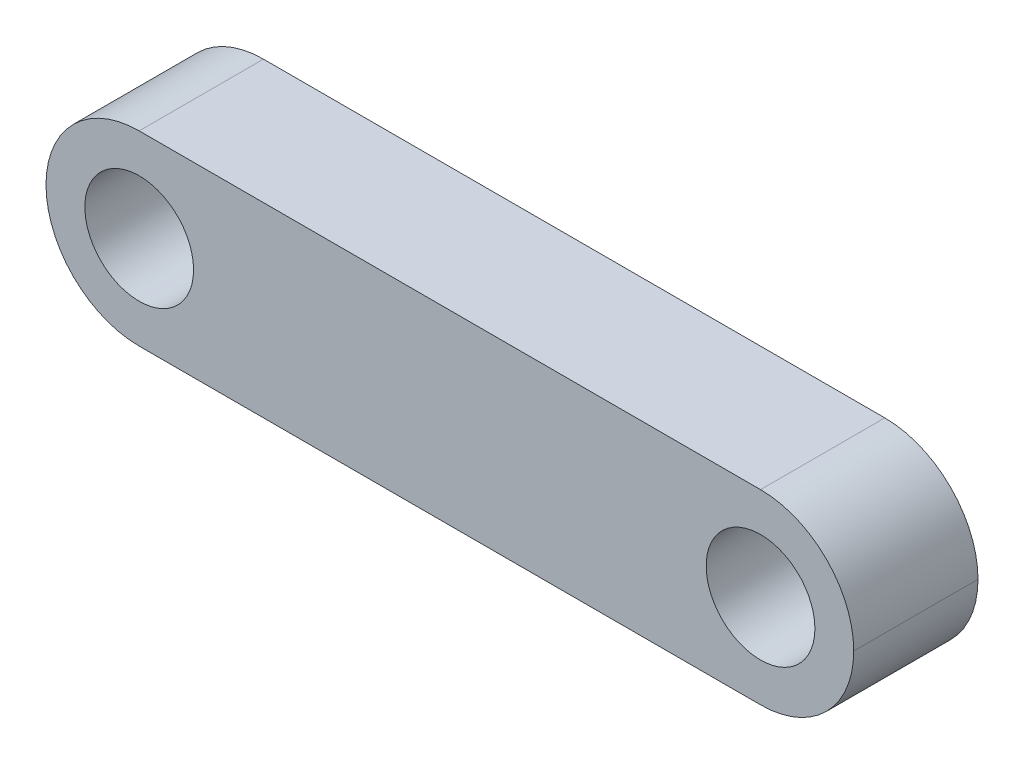
ISO-10303-21;
HEADER;
FILE_DESCRIPTION(('STEP AP214'),'2;1');
FILE_NAME('part.step','',(''),(''),'','','');
FILE_SCHEMA(('AUTOMOTIVE_DESIGN { 1 0 10303 214 1 1 1 1 }'));
ENDSEC;
DATA;
#1=APPLICATION_CONTEXT('core data for automotive mechanical design processes');
#2=APPLICATION_PROTOCOL_DEFINITION('international standard','automotive_design',2000,#1);
#3=PRODUCT_CONTEXT('',#1,'mechanical');
#4=PRODUCT('Part','Part','',(#3));
#5=PRODUCT_RELATED_PRODUCT_CATEGORY('part','',(#4));
#6=PRODUCT_DEFINITION_FORMATION('','',#4);
#7=PRODUCT_DEFINITION_CONTEXT('part definition',#1,'design');
#8=PRODUCT_DEFINITION('design','',#6,#7);
#9=PRODUCT_DEFINITION_SHAPE('','',#8);
#10=(LENGTH_UNIT() NAMED_UNIT(*) SI_UNIT(.MILLI.,.METRE.));
#11=(NAMED_UNIT(*) PLANE_ANGLE_UNIT() SI_UNIT($,.RADIAN.));
#12=(NAMED_UNIT(*) SI_UNIT($,.STERADIAN.) SOLID_ANGLE_UNIT());
#13=UNCERTAINTY_MEASURE_WITH_UNIT(LENGTH_MEASURE(1.E-05),#10,'distance_accuracy_value','');
#14=(GEOMETRIC_REPRESENTATION_CONTEXT(3) GLOBAL_UNCERTAINTY_ASSIGNED_CONTEXT((#13)) GLOBAL_UNIT_ASSIGNED_CONTEXT((#10,
#11,#12)) REPRESENTATION_CONTEXT('',''));
#15=CARTESIAN_POINT('',(0.,0.,0.));
#16=DIRECTION('',(0.,0.,1.));
#17=DIRECTION('',(1.,0.,0.));
#18=AXIS2_PLACEMENT_3D('',#15,#16,#17);
#19=CARTESIAN_POINT('',(0.,0.,4.));
#20=DIRECTION('',(0.,0.,1.));
#21=DIRECTION('',(1.,0.,0.));
#22=AXIS2_PLACEMENT_3D('',#19,#20,#21);
#23=PLANE('',#22);
#24=CARTESIAN_POINT('',(1.6900068585824,2.82485258515874,4.));
#25=DIRECTION('',(0.,0.,1.));
#26=DIRECTION('',(1.,0.,0.));
#27=AXIS2_PLACEMENT_3D('',#24,#25,#26);
#28=CIRCLE('',#27,1.75);
#29=CARTESIAN_POINT('',(3.4400068585824,2.82485258515874,4.));
#30=VERTEX_POINT('',#29);
#31=EDGE_CURVE('E121',#30,#30,#28,.T.);
#32=ORIENTED_EDGE('',*,*,#31,.F.);
#33=EDGE_LOOP('',(#32));
#34=FACE_BOUND('',#33,.T.);
#35=CARTESIAN_POINT('',(1.6900068585824,2.82485258515874,4.));
#36=DIRECTION('',(0.,0.,1.));
#37=DIRECTION('',(1.,0.,0.));
#38=AXIS2_PLACEMENT_3D('',#35,#36,#37);
#39=CIRCLE('',#38,3.);
#40=CARTESIAN_POINT('',(1.6900068585824,-0.175147414841259,4.));
#41=VERTEX_POINT('',#40);
#42=CARTESIAN_POINT('',(4.6900068585824,2.82485258515874,4.));
#43=VERTEX_POINT('',#42);
#44=EDGE_CURVE('E54',#41,#43,#39,.T.);
#45=ORIENTED_EDGE('',*,*,#44,.T.);
#46=CARTESIAN_POINT('',(1.6900068585824,2.82485258515874,4.));
#47=DIRECTION('',(0.,0.,1.));
#48=DIRECTION('',(1.,0.,0.));
#49=AXIS2_PLACEMENT_3D('',#46,#47,#48);
#50=CIRCLE('',#49,3.);
#51=CARTESIAN_POINT('',(1.6900068585824,5.82485258515874,4.));
#52=VERTEX_POINT('',#51);
#53=EDGE_CURVE('E139',#43,#52,#50,.T.);
#54=ORIENTED_EDGE('',*,*,#53,.T.);
#55=DIRECTION('',(-1.,0.,0.));
#56=VECTOR('',#55,1.);
#57=CARTESIAN_POINT('',(4.6900068585824,5.82485258515874,4.));
#58=LINE('',#57,#56);
#59=CARTESIAN_POINT('',(-18.3099931414176,5.82485258515874,4.));
#60=VERTEX_POINT('',#59);
#61=EDGE_CURVE('E112',#52,#60,#58,.T.);
#62=ORIENTED_EDGE('',*,*,#61,.T.);
#63=CARTESIAN_POINT('',(-18.3099931414176,2.82485258515874,4.));
#64=DIRECTION('',(0.,0.,1.));
#65=DIRECTION('',(1.,0.,0.));
#66=AXIS2_PLACEMENT_3D('',#63,#64,#65);
#67=CIRCLE('',#66,3.);
#68=CARTESIAN_POINT('',(-21.3099931414176,2.82485258515874,4.));
#69=VERTEX_POINT('',#68);
#70=EDGE_CURVE('E136',#60,#69,#67,.T.);
#71=ORIENTED_EDGE('',*,*,#70,.T.);
#72=CARTESIAN_POINT('',(-18.3099931414176,2.82485258515874,4.));
#73=DIRECTION('',(0.,0.,1.));
#74=DIRECTION('',(1.,0.,0.));
#75=AXIS2_PLACEMENT_3D('',#72,#73,#74);
#76=CIRCLE('',#75,3.);
#77=CARTESIAN_POINT('',(-18.3099931414176,-0.175147414841262,4.));
#78=VERTEX_POINT('',#77);
#79=EDGE_CURVE('E101',#69,#78,#76,.T.);
#80=ORIENTED_EDGE('',*,*,#79,.T.);
#81=DIRECTION('',(1.,0.,0.));
#82=VECTOR('',#81,1.);
#83=CARTESIAN_POINT('',(4.6900068585824,-0.175147414841259,4.));
#84=LINE('',#83,#82);
#85=EDGE_CURVE('E128',#78,#41,#84,.T.);
#86=ORIENTED_EDGE('',*,*,#85,.T.);
#87=EDGE_LOOP('',(#45,#54,#62,#71,#80,#86));
#88=FACE_BOUND('',#87,.T.);
#89=CARTESIAN_POINT('',(-18.3099931414176,2.82485258515874,4.));
#90=DIRECTION('',(0.,0.,1.));
#91=DIRECTION('',(1.,0.,0.));
#92=AXIS2_PLACEMENT_3D('',#89,#90,#91);
#93=CIRCLE('',#92,1.75);
#94=CARTESIAN_POINT('',(-16.5599931414176,2.82485258515874,4.));
#95=VERTEX_POINT('',#94);
#96=EDGE_CURVE('E143',#95,#95,#93,.T.);
#97=ORIENTED_EDGE('',*,*,#96,.F.);
#98=EDGE_LOOP('',(#97));
#99=FACE_BOUND('',#98,.T.);
#100=ADVANCED_FACE('F37',(#34,#88,#99),#23,.T.);
#101=CARTESIAN_POINT('',(0.,0.,0.));
#102=DIRECTION('',(0.,0.,1.));
#103=DIRECTION('',(1.,0.,0.));
#104=AXIS2_PLACEMENT_3D('',#101,#102,#103);
#105=PLANE('',#104);
#106=DIRECTION('',(-1.,0.,0.));
#107=VECTOR('',#106,1.);
#108=CARTESIAN_POINT('',(4.6900068585824,5.82485258515874,0.));
#109=LINE('',#108,#107);
#110=CARTESIAN_POINT('',(1.6900068585824,5.82485258515874,0.));
#111=VERTEX_POINT('',#110);
#112=CARTESIAN_POINT('',(-18.3099931414176,5.82485258515874,0.));
#113=VERTEX_POINT('',#112);
#114=EDGE_CURVE('E109',#111,#113,#109,.T.);
#115=ORIENTED_EDGE('',*,*,#114,.F.);
#116=CARTESIAN_POINT('',(1.6900068585824,2.82485258515874,0.));
#117=DIRECTION('',(0.,0.,1.));
#118=DIRECTION('',(1.,0.,0.));
#119=AXIS2_PLACEMENT_3D('',#116,#117,#118);
#120=CIRCLE('',#119,3.);
#121=CARTESIAN_POINT('',(4.6900068585824,2.82485258515874,0.));
#122=VERTEX_POINT('',#121);
#123=EDGE_CURVE('E92',#111,#122,#120,.F.);
#124=ORIENTED_EDGE('',*,*,#123,.T.);
#125=CARTESIAN_POINT('',(1.6900068585824,2.82485258515874,0.));
#126=DIRECTION('',(0.,0.,1.));
#127=DIRECTION('',(1.,0.,0.));
#128=AXIS2_PLACEMENT_3D('',#125,#126,#127);
#129=CIRCLE('',#128,3.);
#130=CARTESIAN_POINT('',(1.6900068585824,-0.175147414841259,0.));
#131=VERTEX_POINT('',#130);
#132=EDGE_CURVE('E102',#122,#131,#129,.F.);
#133=ORIENTED_EDGE('',*,*,#132,.T.);
#134=DIRECTION('',(1.,0.,0.));
#135=VECTOR('',#134,1.);
#136=CARTESIAN_POINT('',(4.6900068585824,-0.175147414841259,0.));
#137=LINE('',#136,#135);
#138=CARTESIAN_POINT('',(-18.3099931414176,-0.175147414841262,0.));
#139=VERTEX_POINT('',#138);
#140=EDGE_CURVE('E120',#139,#131,#137,.T.);
#141=ORIENTED_EDGE('',*,*,#140,.F.);
#142=CARTESIAN_POINT('',(-18.3099931414176,2.82485258515874,0.));
#143=DIRECTION('',(0.,0.,1.));
#144=DIRECTION('',(1.,0.,0.));
#145=AXIS2_PLACEMENT_3D('',#142,#143,#144);
#146=CIRCLE('',#145,3.);
#147=CARTESIAN_POINT('',(-21.3099931414176,2.82485258515874,0.));
#148=VERTEX_POINT('',#147);
#149=EDGE_CURVE('E113',#139,#148,#146,.F.);
#150=ORIENTED_EDGE('',*,*,#149,.T.);
#151=CARTESIAN_POINT('',(-18.3099931414176,2.82485258515874,0.));
#152=DIRECTION('',(0.,0.,1.));
#153=DIRECTION('',(1.,0.,0.));
#154=AXIS2_PLACEMENT_3D('',#151,#152,#153);
#155=CIRCLE('',#154,3.);
#156=EDGE_CURVE('E119',#148,#113,#155,.F.);
#157=ORIENTED_EDGE('',*,*,#156,.T.);
#158=EDGE_LOOP('',(#115,#124,#133,#141,#150,#157));
#159=FACE_BOUND('',#158,.T.);
#160=CARTESIAN_POINT('',(1.6900068585824,2.82485258515874,0.));
#161=DIRECTION('',(0.,0.,1.));
#162=DIRECTION('',(1.,0.,0.));
#163=AXIS2_PLACEMENT_3D('',#160,#161,#162);
#164=CIRCLE('',#163,1.75);
#165=CARTESIAN_POINT('',(3.4400068585824,2.82485258515874,0.));
#166=VERTEX_POINT('',#165);
#167=EDGE_CURVE('E125',#166,#166,#164,.T.);
#168=ORIENTED_EDGE('',*,*,#167,.T.);
#169=EDGE_LOOP('',(#168));
#170=FACE_BOUND('',#169,.T.);
#171=CARTESIAN_POINT('',(-18.3099931414176,2.82485258515874,0.));
#172=DIRECTION('',(0.,0.,1.));
#173=DIRECTION('',(1.,0.,0.));
#174=AXIS2_PLACEMENT_3D('',#171,#172,#173);
#175=CIRCLE('',#174,1.75);
#176=CARTESIAN_POINT('',(-16.5599931414176,2.82485258515874,0.));
#177=VERTEX_POINT('',#176);
#178=EDGE_CURVE('E141',#177,#177,#175,.T.);
#179=ORIENTED_EDGE('',*,*,#178,.T.);
#180=EDGE_LOOP('',(#179));
#181=FACE_BOUND('',#180,.T.);
#182=ADVANCED_FACE('F116',(#159,#170,#181),#105,.F.);
#183=CARTESIAN_POINT('',(4.6900068585824,5.82485258515874,4.));
#184=DIRECTION('',(0.,-1.,0.));
#185=DIRECTION('',(1.,0.,0.));
#186=AXIS2_PLACEMENT_3D('',#183,#184,#185);
#187=PLANE('',#186);
#188=ORIENTED_EDGE('',*,*,#61,.F.);
#189=DIRECTION('',(0.,0.,-1.));
#190=VECTOR('',#189,1.);
#191=CARTESIAN_POINT('',(1.6900068585824,5.82485258515874,4.));
#192=LINE('',#191,#190);
#193=EDGE_CURVE('E96',#52,#111,#192,.T.);
#194=ORIENTED_EDGE('',*,*,#193,.T.);
#195=ORIENTED_EDGE('',*,*,#114,.T.);
#196=DIRECTION('',(0.,0.,-1.));
#197=VECTOR('',#196,1.);
#198=CARTESIAN_POINT('',(-18.3099931414176,5.82485258515874,4.));
#199=LINE('',#198,#197);
#200=EDGE_CURVE('E114',#113,#60,#199,.F.);
#201=ORIENTED_EDGE('',*,*,#200,.T.);
#202=EDGE_LOOP('',(#188,#194,#195,#201));
#203=FACE_BOUND('',#202,.T.);
#204=ADVANCED_FACE('F107',(#203),#187,.F.);
#205=CARTESIAN_POINT('',(4.6900068585824,-0.175147414841259,4.));
#206=DIRECTION('',(0.,1.,0.));
#207=DIRECTION('',(-1.,0.,0.));
#208=AXIS2_PLACEMENT_3D('',#205,#206,#207);
#209=PLANE('',#208);
#210=ORIENTED_EDGE('',*,*,#140,.T.);
#211=DIRECTION('',(0.,0.,-1.));
#212=VECTOR('',#211,1.);
#213=CARTESIAN_POINT('',(1.6900068585824,-0.175147414841259,4.));
#214=LINE('',#213,#212);
#215=EDGE_CURVE('E11',#131,#41,#214,.F.);
#216=ORIENTED_EDGE('',*,*,#215,.T.);
#217=ORIENTED_EDGE('',*,*,#85,.F.);
#218=DIRECTION('',(0.,0.,-1.));
#219=VECTOR('',#218,1.);
#220=CARTESIAN_POINT('',(-18.3099931414176,-0.175147414841262,4.));
#221=LINE('',#220,#219);
#222=EDGE_CURVE('E46',#78,#139,#221,.T.);
#223=ORIENTED_EDGE('',*,*,#222,.T.);
#224=EDGE_LOOP('',(#210,#216,#217,#223));
#225=FACE_BOUND('',#224,.T.);
#226=ADVANCED_FACE('F154',(#225),#209,.F.);
#227=CARTESIAN_POINT('',(1.6900068585824,2.82485258515874,4.));
#228=DIRECTION('',(0.,0.,-1.));
#229=DIRECTION('',(-1.,0.,0.));
#230=AXIS2_PLACEMENT_3D('',#227,#228,#229);
#231=CYLINDRICAL_SURFACE('',#230,1.75);
#232=ORIENTED_EDGE('',*,*,#31,.T.);
#233=EDGE_LOOP('',(#232));
#234=FACE_BOUND('',#233,.T.);
#235=ORIENTED_EDGE('',*,*,#167,.F.);
#236=EDGE_LOOP('',(#235));
#237=FACE_BOUND('',#236,.T.);
#238=ADVANCED_FACE('F173',(#234,#237),#231,.F.);
#239=CARTESIAN_POINT('',(-18.3099931414176,2.82485258515874,4.));
#240=DIRECTION('',(0.,0.,-1.));
#241=DIRECTION('',(-1.,0.,0.));
#242=AXIS2_PLACEMENT_3D('',#239,#240,#241);
#243=CYLINDRICAL_SURFACE('',#242,1.75);
#244=ORIENTED_EDGE('',*,*,#96,.T.);
#245=EDGE_LOOP('',(#244));
#246=FACE_BOUND('',#245,.T.);
#247=ORIENTED_EDGE('',*,*,#178,.F.);
#248=EDGE_LOOP('',(#247));
#249=FACE_BOUND('',#248,.T.);
#250=ADVANCED_FACE('F162',(#246,#249),#243,.F.);
#251=CARTESIAN_POINT('',(1.6900068585824,2.82485258515874,4.));
#252=DIRECTION('',(0.,0.,-1.));
#253=DIRECTION('',(-1.,0.,0.));
#254=AXIS2_PLACEMENT_3D('',#251,#252,#253);
#255=CYLINDRICAL_SURFACE('',#254,3.);
#256=DIRECTION('',(0.,0.,-1.));
#257=VECTOR('',#256,1.);
#258=CARTESIAN_POINT('',(4.6900068585824,2.82485258515874,4.));
#259=LINE('',#258,#257);
#260=EDGE_CURVE('E97',#43,#122,#259,.T.);
#261=ORIENTED_EDGE('',*,*,#260,.F.);
#262=ORIENTED_EDGE('',*,*,#44,.F.);
#263=ORIENTED_EDGE('',*,*,#215,.F.);
#264=ORIENTED_EDGE('',*,*,#132,.F.);
#265=EDGE_LOOP('',(#261,#262,#263,#264));
#266=FACE_BOUND('',#265,.T.);
#267=ADVANCED_FACE('F182',(#266),#255,.T.);
#268=CARTESIAN_POINT('',(1.6900068585824,2.82485258515874,4.));
#269=DIRECTION('',(0.,0.,-1.));
#270=DIRECTION('',(-1.,0.,0.));
#271=AXIS2_PLACEMENT_3D('',#268,#269,#270);
#272=CYLINDRICAL_SURFACE('',#271,3.);
#273=ORIENTED_EDGE('',*,*,#53,.F.);
#274=ORIENTED_EDGE('',*,*,#260,.T.);
#275=ORIENTED_EDGE('',*,*,#123,.F.);
#276=ORIENTED_EDGE('',*,*,#193,.F.);
#277=EDGE_LOOP('',(#273,#274,#275,#276));
#278=FACE_BOUND('',#277,.T.);
#279=ADVANCED_FACE('F95',(#278),#272,.T.);
#280=CARTESIAN_POINT('',(-18.3099931414176,2.82485258515874,4.));
#281=DIRECTION('',(0.,0.,-1.));
#282=DIRECTION('',(-1.,0.,0.));
#283=AXIS2_PLACEMENT_3D('',#280,#281,#282);
#284=CYLINDRICAL_SURFACE('',#283,3.);
#285=ORIENTED_EDGE('',*,*,#222,.F.);
#286=ORIENTED_EDGE('',*,*,#79,.F.);
#287=DIRECTION('',(0.,0.,-1.));
#288=VECTOR('',#287,1.);
#289=CARTESIAN_POINT('',(-21.3099931414176,2.82485258515874,4.));
#290=LINE('',#289,#288);
#291=EDGE_CURVE('E41',#148,#69,#290,.F.);
#292=ORIENTED_EDGE('',*,*,#291,.F.);
#293=ORIENTED_EDGE('',*,*,#149,.F.);
#294=EDGE_LOOP('',(#285,#286,#292,#293));
#295=FACE_BOUND('',#294,.T.);
#296=ADVANCED_FACE('F39',(#295),#284,.T.);
#297=CARTESIAN_POINT('',(-18.3099931414176,2.82485258515874,4.));
#298=DIRECTION('',(0.,0.,-1.));
#299=DIRECTION('',(-1.,0.,0.));
#300=AXIS2_PLACEMENT_3D('',#297,#298,#299);
#301=CYLINDRICAL_SURFACE('',#300,3.);
#302=ORIENTED_EDGE('',*,*,#70,.F.);
#303=ORIENTED_EDGE('',*,*,#200,.F.);
#304=ORIENTED_EDGE('',*,*,#156,.F.);
#305=ORIENTED_EDGE('',*,*,#291,.T.);
#306=EDGE_LOOP('',(#302,#303,#304,#305));
#307=FACE_BOUND('',#306,.T.);
#308=ADVANCED_FACE('F148',(#307),#301,.T.);
#309=CLOSED_SHELL('',(#100,#182,#204,#226,#238,#250,#267,#279,#296,#308));
#310=MANIFOLD_SOLID_BREP('B2',#309);
#311=ADVANCED_BREP_SHAPE_REPRESENTATION('',(#18,#310),#14);
#312=SHAPE_DEFINITION_REPRESENTATION(#9,#311);
ENDSEC;
END-ISO-10303-21;
